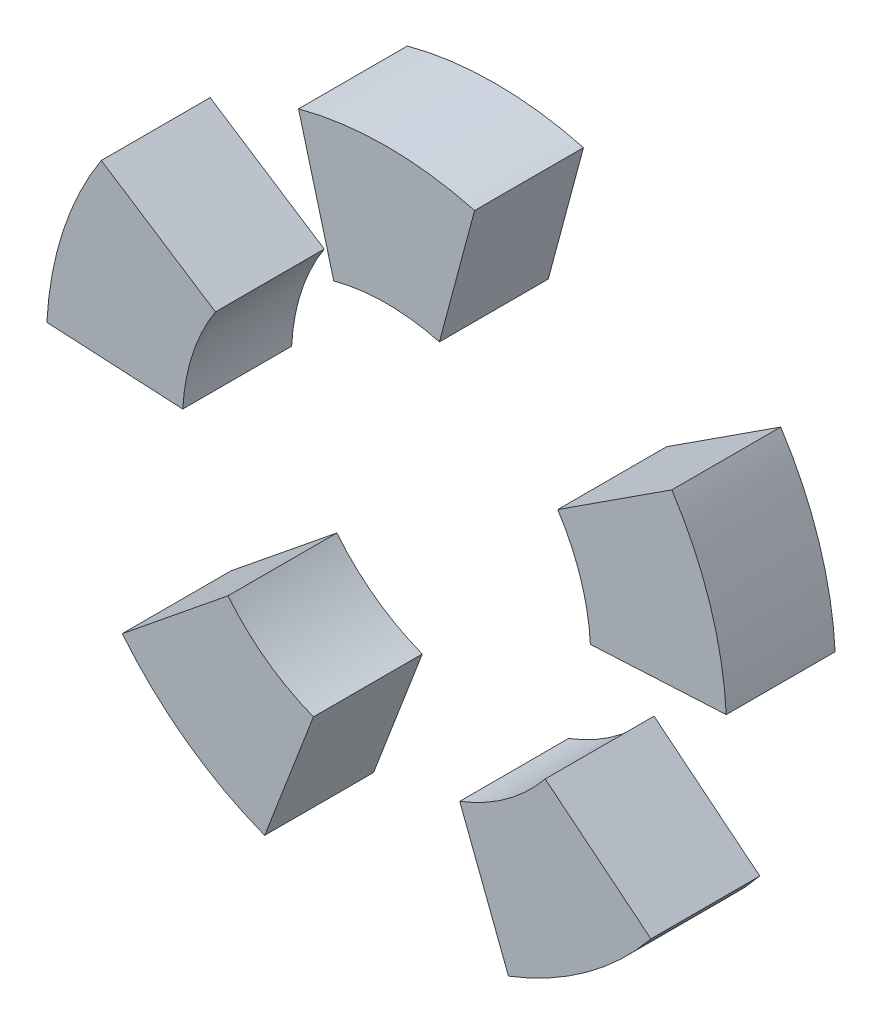
ISO-10303-21;
HEADER;
FILE_DESCRIPTION(('STEP AP214'),'2;1');
FILE_NAME('part.step','',(''),(''),'','','');
FILE_SCHEMA(('AUTOMOTIVE_DESIGN { 1 0 10303 214 1 1 1 1 }'));
ENDSEC;
DATA;
#1=APPLICATION_CONTEXT('core data for automotive mechanical design processes');
#2=APPLICATION_PROTOCOL_DEFINITION('international standard','automotive_design',2000,#1);
#3=PRODUCT_CONTEXT('',#1,'mechanical');
#4=PRODUCT('Part','Part','',(#3));
#5=PRODUCT_RELATED_PRODUCT_CATEGORY('part','',(#4));
#6=PRODUCT_DEFINITION_FORMATION('','',#4);
#7=PRODUCT_DEFINITION_CONTEXT('part definition',#1,'design');
#8=PRODUCT_DEFINITION('design','',#6,#7);
#9=PRODUCT_DEFINITION_SHAPE('','',#8);
#10=(LENGTH_UNIT() NAMED_UNIT(*) SI_UNIT(.MILLI.,.METRE.));
#11=(NAMED_UNIT(*) PLANE_ANGLE_UNIT() SI_UNIT($,.RADIAN.));
#12=(NAMED_UNIT(*) SI_UNIT($,.STERADIAN.) SOLID_ANGLE_UNIT());
#13=UNCERTAINTY_MEASURE_WITH_UNIT(LENGTH_MEASURE(1.E-05),#10,'distance_accuracy_value','');
#14=(GEOMETRIC_REPRESENTATION_CONTEXT(3) GLOBAL_UNCERTAINTY_ASSIGNED_CONTEXT((#13)) GLOBAL_UNIT_ASSIGNED_CONTEXT((#10,
#11,#12)) REPRESENTATION_CONTEXT('',''));
#15=CARTESIAN_POINT('',(0.,0.,0.));
#16=DIRECTION('',(0.,0.,1.));
#17=DIRECTION('',(1.,0.,0.));
#18=AXIS2_PLACEMENT_3D('',#15,#16,#17);
#19=CARTESIAN_POINT('',(0.,0.,8.));
#20=DIRECTION('',(0.,0.,-1.));
#21=DIRECTION('',(-1.,0.,0.));
#22=AXIS2_PLACEMENT_3D('',#19,#20,#21);
#23=CYLINDRICAL_SURFACE('',#22,25.);
#24=CARTESIAN_POINT('',(0.,0.,0.));
#25=DIRECTION('',(0.,0.,1.));
#26=DIRECTION('',(1.,0.,0.));
#27=AXIS2_PLACEMENT_3D('',#24,#25,#26);
#28=CIRCLE('',#27,25.);
#29=CARTESIAN_POINT('',(-19.4286490364245,-15.7330097762457,0.));
#30=VERTEX_POINT('',#29);
#31=CARTESIAN_POINT('',(-8.95919873863276,-23.33951066243,0.));
#32=VERTEX_POINT('',#31);
#33=EDGE_CURVE('E113',#30,#32,#28,.T.);
#34=ORIENTED_EDGE('',*,*,#33,.T.);
#35=DIRECTION('',(0.,0.,-1.));
#36=VECTOR('',#35,1.);
#37=CARTESIAN_POINT('',(-8.95919873863276,-23.33951066243,8.));
#38=LINE('',#37,#36);
#39=CARTESIAN_POINT('',(-8.95919873863276,-23.33951066243,8.));
#40=VERTEX_POINT('',#39);
#41=EDGE_CURVE('E12',#40,#32,#38,.T.);
#42=ORIENTED_EDGE('',*,*,#41,.F.);
#43=CARTESIAN_POINT('',(0.,0.,8.));
#44=DIRECTION('',(0.,0.,1.));
#45=DIRECTION('',(1.,0.,0.));
#46=AXIS2_PLACEMENT_3D('',#43,#44,#45);
#47=CIRCLE('',#46,25.);
#48=CARTESIAN_POINT('',(-19.4286490364245,-15.7330097762457,8.));
#49=VERTEX_POINT('',#48);
#50=EDGE_CURVE('E101',#49,#40,#47,.T.);
#51=ORIENTED_EDGE('',*,*,#50,.F.);
#52=DIRECTION('',(0.,0.,-1.));
#53=VECTOR('',#52,1.);
#54=CARTESIAN_POINT('',(-19.4286490364245,-15.7330097762457,8.));
#55=LINE('',#54,#53);
#56=EDGE_CURVE('E109',#49,#30,#55,.T.);
#57=ORIENTED_EDGE('',*,*,#56,.T.);
#58=EDGE_LOOP('',(#34,#42,#51,#57));
#59=FACE_BOUND('',#58,.T.);
#60=ADVANCED_FACE('F50',(#59),#23,.T.);
#61=CARTESIAN_POINT('',(-5.37551924317976,-14.0037063974579,8.));
#62=DIRECTION('',(-0.933580426497202,0.358367949545299,0.));
#63=DIRECTION('',(-0.3583679495453,-0.933580426497202,0.));
#64=AXIS2_PLACEMENT_3D('',#61,#62,#63);
#65=PLANE('',#64);
#66=DIRECTION('',(0.358367949545299,0.933580426497202,0.));
#67=VECTOR('',#66,1.);
#68=CARTESIAN_POINT('',(-5.37551924317976,-14.0037063974579,0.));
#69=LINE('',#68,#67);
#70=CARTESIAN_POINT('',(-5.37551924317976,-14.0037063974579,0.));
#71=VERTEX_POINT('',#70);
#72=EDGE_CURVE('E105',#32,#71,#69,.T.);
#73=ORIENTED_EDGE('',*,*,#72,.T.);
#74=DIRECTION('',(0.,0.,-1.));
#75=VECTOR('',#74,1.);
#76=CARTESIAN_POINT('',(-5.37551924317976,-14.0037063974579,8.));
#77=LINE('',#76,#75);
#78=CARTESIAN_POINT('',(-5.37551924317976,-14.0037063974579,8.));
#79=VERTEX_POINT('',#78);
#80=EDGE_CURVE('E58',#79,#71,#77,.T.);
#81=ORIENTED_EDGE('',*,*,#80,.F.);
#82=DIRECTION('',(0.358367949545299,0.933580426497202,0.));
#83=VECTOR('',#82,1.);
#84=CARTESIAN_POINT('',(-5.37551924317976,-14.0037063974579,8.));
#85=LINE('',#84,#83);
#86=EDGE_CURVE('E96',#40,#79,#85,.T.);
#87=ORIENTED_EDGE('',*,*,#86,.F.);
#88=ORIENTED_EDGE('',*,*,#41,.T.);
#89=EDGE_LOOP('',(#73,#81,#87,#88));
#90=FACE_BOUND('',#89,.T.);
#91=ADVANCED_FACE('F104',(#90),#65,.F.);
#92=CARTESIAN_POINT('',(0.,0.,8.));
#93=DIRECTION('',(0.,0.,-1.));
#94=DIRECTION('',(-1.,0.,0.));
#95=AXIS2_PLACEMENT_3D('',#92,#93,#94);
#96=CYLINDRICAL_SURFACE('',#95,15.);
#97=CARTESIAN_POINT('',(0.,0.,0.));
#98=DIRECTION('',(0.,0.,-1.));
#99=DIRECTION('',(1.,0.,0.));
#100=AXIS2_PLACEMENT_3D('',#97,#98,#99);
#101=CIRCLE('',#100,15.);
#102=CARTESIAN_POINT('',(-11.6571894218548,-9.43980586574733,0.));
#103=VERTEX_POINT('',#102);
#104=EDGE_CURVE('E83',#71,#103,#101,.T.);
#105=ORIENTED_EDGE('',*,*,#104,.T.);
#106=DIRECTION('',(0.,0.,-1.));
#107=VECTOR('',#106,1.);
#108=CARTESIAN_POINT('',(-11.6571894218548,-9.43980586574733,8.));
#109=LINE('',#108,#107);
#110=CARTESIAN_POINT('',(-11.6571894218548,-9.43980586574733,8.));
#111=VERTEX_POINT('',#110);
#112=EDGE_CURVE('E106',#111,#103,#109,.T.);
#113=ORIENTED_EDGE('',*,*,#112,.F.);
#114=CARTESIAN_POINT('',(0.,0.,8.));
#115=DIRECTION('',(0.,0.,-1.));
#116=DIRECTION('',(1.,0.,0.));
#117=AXIS2_PLACEMENT_3D('',#114,#115,#116);
#118=CIRCLE('',#117,15.);
#119=EDGE_CURVE('E99',#79,#111,#118,.T.);
#120=ORIENTED_EDGE('',*,*,#119,.F.);
#121=ORIENTED_EDGE('',*,*,#80,.T.);
#122=EDGE_LOOP('',(#105,#113,#120,#121));
#123=FACE_BOUND('',#122,.T.);
#124=ADVANCED_FACE('F107',(#123),#96,.F.);
#125=CARTESIAN_POINT('',(-11.6571894218548,-9.43980586574733,8.));
#126=DIRECTION('',(0.629320391049837,-0.777145961456971,0.));
#127=DIRECTION('',(0.777145961456971,0.629320391049837,0.));
#128=AXIS2_PLACEMENT_3D('',#125,#126,#127);
#129=PLANE('',#128);
#130=DIRECTION('',(-0.777145961456971,-0.629320391049837,0.));
#131=VECTOR('',#130,1.);
#132=CARTESIAN_POINT('',(-11.6571894218548,-9.43980586574733,0.));
#133=LINE('',#132,#131);
#134=EDGE_CURVE('E89',#103,#30,#133,.T.);
#135=ORIENTED_EDGE('',*,*,#134,.T.);
#136=ORIENTED_EDGE('',*,*,#56,.F.);
#137=DIRECTION('',(-0.777145961456971,-0.629320391049837,0.));
#138=VECTOR('',#137,1.);
#139=CARTESIAN_POINT('',(-11.6571894218548,-9.43980586574733,8.));
#140=LINE('',#139,#138);
#141=EDGE_CURVE('E66',#111,#49,#140,.T.);
#142=ORIENTED_EDGE('',*,*,#141,.F.);
#143=ORIENTED_EDGE('',*,*,#112,.T.);
#144=EDGE_LOOP('',(#135,#136,#142,#143));
#145=FACE_BOUND('',#144,.T.);
#146=ADVANCED_FACE('F120',(#145),#129,.F.);
#147=CARTESIAN_POINT('',(0.,0.,8.));
#148=DIRECTION('',(0.,0.,1.));
#149=DIRECTION('',(1.,0.,0.));
#150=AXIS2_PLACEMENT_3D('',#147,#148,#149);
#151=PLANE('',#150);
#152=ORIENTED_EDGE('',*,*,#50,.T.);
#153=ORIENTED_EDGE('',*,*,#86,.T.);
#154=ORIENTED_EDGE('',*,*,#119,.T.);
#155=ORIENTED_EDGE('',*,*,#141,.T.);
#156=EDGE_LOOP('',(#152,#153,#154,#155));
#157=FACE_BOUND('',#156,.T.);
#158=ADVANCED_FACE('F97',(#157),#151,.T.);
#159=CARTESIAN_POINT('',(0.,0.,0.));
#160=DIRECTION('',(0.,0.,1.));
#161=DIRECTION('',(1.,0.,0.));
#162=AXIS2_PLACEMENT_3D('',#159,#160,#161);
#163=PLANE('',#162);
#164=ORIENTED_EDGE('',*,*,#33,.F.);
#165=ORIENTED_EDGE('',*,*,#134,.F.);
#166=ORIENTED_EDGE('',*,*,#104,.F.);
#167=ORIENTED_EDGE('',*,*,#72,.F.);
#168=EDGE_LOOP('',(#164,#165,#166,#167));
#169=FACE_BOUND('',#168,.T.);
#170=ADVANCED_FACE('F123',(#169),#163,.F.);
#171=CLOSED_SHELL('',(#60,#91,#124,#146,#158,#170));
#172=MANIFOLD_SOLID_BREP('B2',#171);
#173=CARTESIAN_POINT('',(0.,0.,8.));
#174=DIRECTION('',(0.,0.,-1.));
#175=DIRECTION('',(-1.,0.,0.));
#176=AXIS2_PLACEMENT_3D('',#173,#174,#175);
#177=CYLINDRICAL_SURFACE('',#176,25.);
#178=CARTESIAN_POINT('',(0.,0.,0.));
#179=DIRECTION('',(0.,0.,1.));
#180=DIRECTION('',(1.,0.,0.));
#181=AXIS2_PLACEMENT_3D('',#178,#179,#180);
#182=CIRCLE('',#181,25.);
#183=CARTESIAN_POINT('',(8.95919873863223,-23.3395106624302,0.));
#184=VERTEX_POINT('',#183);
#185=CARTESIAN_POINT('',(19.4286490364241,-15.7330097762461,0.));
#186=VERTEX_POINT('',#185);
#187=EDGE_CURVE('E247',#184,#186,#182,.T.);
#188=ORIENTED_EDGE('',*,*,#187,.T.);
#189=DIRECTION('',(0.,0.,-1.));
#190=VECTOR('',#189,1.);
#191=CARTESIAN_POINT('',(19.4286490364241,-15.7330097762461,8.));
#192=LINE('',#191,#190);
#193=CARTESIAN_POINT('',(19.4286490364241,-15.7330097762461,8.));
#194=VERTEX_POINT('',#193);
#195=EDGE_CURVE('E48',#194,#186,#192,.T.);
#196=ORIENTED_EDGE('',*,*,#195,.F.);
#197=CARTESIAN_POINT('',(0.,0.,8.));
#198=DIRECTION('',(0.,0.,1.));
#199=DIRECTION('',(1.,0.,0.));
#200=AXIS2_PLACEMENT_3D('',#197,#198,#199);
#201=CIRCLE('',#200,25.);
#202=CARTESIAN_POINT('',(8.95919873863223,-23.3395106624302,8.));
#203=VERTEX_POINT('',#202);
#204=EDGE_CURVE('E235',#203,#194,#201,.T.);
#205=ORIENTED_EDGE('',*,*,#204,.F.);
#206=DIRECTION('',(0.,0.,-1.));
#207=VECTOR('',#206,1.);
#208=CARTESIAN_POINT('',(8.95919873863223,-23.3395106624302,8.));
#209=LINE('',#208,#207);
#210=EDGE_CURVE('E243',#203,#184,#209,.T.);
#211=ORIENTED_EDGE('',*,*,#210,.T.);
#212=EDGE_LOOP('',(#188,#196,#205,#211));
#213=FACE_BOUND('',#212,.T.);
#214=ADVANCED_FACE('F184',(#213),#177,.T.);
#215=CARTESIAN_POINT('',(11.6571894218544,-9.43980586574777,8.));
#216=DIRECTION('',(-0.629320391049837,-0.777145961456971,0.));
#217=DIRECTION('',(0.777145961456971,-0.629320391049837,0.));
#218=AXIS2_PLACEMENT_3D('',#215,#216,#217);
#219=PLANE('',#218);
#220=DIRECTION('',(-0.777145961456971,0.629320391049837,0.));
#221=VECTOR('',#220,1.);
#222=CARTESIAN_POINT('',(11.6571894218544,-9.43980586574777,0.));
#223=LINE('',#222,#221);
#224=CARTESIAN_POINT('',(11.6571894218544,-9.43980586574778,0.));
#225=VERTEX_POINT('',#224);
#226=EDGE_CURVE('E239',#186,#225,#223,.T.);
#227=ORIENTED_EDGE('',*,*,#226,.T.);
#228=DIRECTION('',(0.,0.,-1.));
#229=VECTOR('',#228,1.);
#230=CARTESIAN_POINT('',(11.6571894218544,-9.43980586574778,8.));
#231=LINE('',#230,#229);
#232=CARTESIAN_POINT('',(11.6571894218544,-9.43980586574778,8.));
#233=VERTEX_POINT('',#232);
#234=EDGE_CURVE('E192',#233,#225,#231,.T.);
#235=ORIENTED_EDGE('',*,*,#234,.F.);
#236=DIRECTION('',(-0.777145961456971,0.629320391049837,0.));
#237=VECTOR('',#236,1.);
#238=CARTESIAN_POINT('',(11.6571894218544,-9.43980586574777,8.));
#239=LINE('',#238,#237);
#240=EDGE_CURVE('E230',#194,#233,#239,.T.);
#241=ORIENTED_EDGE('',*,*,#240,.F.);
#242=ORIENTED_EDGE('',*,*,#195,.T.);
#243=EDGE_LOOP('',(#227,#235,#241,#242));
#244=FACE_BOUND('',#243,.T.);
#245=ADVANCED_FACE('F238',(#244),#219,.F.);
#246=CARTESIAN_POINT('',(0.,0.,8.));
#247=DIRECTION('',(0.,0.,-1.));
#248=DIRECTION('',(-1.,0.,0.));
#249=AXIS2_PLACEMENT_3D('',#246,#247,#248);
#250=CYLINDRICAL_SURFACE('',#249,15.);
#251=CARTESIAN_POINT('',(0.,0.,0.));
#252=DIRECTION('',(0.,0.,-1.));
#253=DIRECTION('',(1.,0.,0.));
#254=AXIS2_PLACEMENT_3D('',#251,#252,#253);
#255=CIRCLE('',#254,15.);
#256=CARTESIAN_POINT('',(5.37551924317923,-14.0037063974581,0.));
#257=VERTEX_POINT('',#256);
#258=EDGE_CURVE('E217',#225,#257,#255,.T.);
#259=ORIENTED_EDGE('',*,*,#258,.T.);
#260=DIRECTION('',(0.,0.,-1.));
#261=VECTOR('',#260,1.);
#262=CARTESIAN_POINT('',(5.37551924317923,-14.0037063974581,8.));
#263=LINE('',#262,#261);
#264=CARTESIAN_POINT('',(5.37551924317923,-14.0037063974581,8.));
#265=VERTEX_POINT('',#264);
#266=EDGE_CURVE('E240',#265,#257,#263,.T.);
#267=ORIENTED_EDGE('',*,*,#266,.F.);
#268=CARTESIAN_POINT('',(0.,0.,8.));
#269=DIRECTION('',(0.,0.,-1.));
#270=DIRECTION('',(1.,0.,0.));
#271=AXIS2_PLACEMENT_3D('',#268,#269,#270);
#272=CIRCLE('',#271,15.);
#273=EDGE_CURVE('E233',#233,#265,#272,.T.);
#274=ORIENTED_EDGE('',*,*,#273,.F.);
#275=ORIENTED_EDGE('',*,*,#234,.T.);
#276=EDGE_LOOP('',(#259,#267,#274,#275));
#277=FACE_BOUND('',#276,.T.);
#278=ADVANCED_FACE('F241',(#277),#250,.F.);
#279=CARTESIAN_POINT('',(5.37551924317923,-14.0037063974581,8.));
#280=DIRECTION('',(0.933580426497202,0.3583679495453,0.));
#281=DIRECTION('',(-0.3583679495453,0.933580426497202,0.));
#282=AXIS2_PLACEMENT_3D('',#279,#280,#281);
#283=PLANE('',#282);
#284=DIRECTION('',(0.3583679495453,-0.933580426497202,0.));
#285=VECTOR('',#284,1.);
#286=CARTESIAN_POINT('',(5.37551924317923,-14.0037063974581,0.));
#287=LINE('',#286,#285);
#288=EDGE_CURVE('E223',#257,#184,#287,.T.);
#289=ORIENTED_EDGE('',*,*,#288,.T.);
#290=ORIENTED_EDGE('',*,*,#210,.F.);
#291=DIRECTION('',(0.3583679495453,-0.933580426497202,0.));
#292=VECTOR('',#291,1.);
#293=CARTESIAN_POINT('',(5.37551924317923,-14.0037063974581,8.));
#294=LINE('',#293,#292);
#295=EDGE_CURVE('E200',#265,#203,#294,.T.);
#296=ORIENTED_EDGE('',*,*,#295,.F.);
#297=ORIENTED_EDGE('',*,*,#266,.T.);
#298=EDGE_LOOP('',(#289,#290,#296,#297));
#299=FACE_BOUND('',#298,.T.);
#300=ADVANCED_FACE('F254',(#299),#283,.F.);
#301=CARTESIAN_POINT('',(0.,0.,8.));
#302=DIRECTION('',(0.,0.,1.));
#303=DIRECTION('',(1.,0.,0.));
#304=AXIS2_PLACEMENT_3D('',#301,#302,#303);
#305=PLANE('',#304);
#306=ORIENTED_EDGE('',*,*,#204,.T.);
#307=ORIENTED_EDGE('',*,*,#240,.T.);
#308=ORIENTED_EDGE('',*,*,#273,.T.);
#309=ORIENTED_EDGE('',*,*,#295,.T.);
#310=EDGE_LOOP('',(#306,#307,#308,#309));
#311=FACE_BOUND('',#310,.T.);
#312=ADVANCED_FACE('F231',(#311),#305,.T.);
#313=CARTESIAN_POINT('',(0.,0.,0.));
#314=DIRECTION('',(0.,0.,1.));
#315=DIRECTION('',(1.,0.,0.));
#316=AXIS2_PLACEMENT_3D('',#313,#314,#315);
#317=PLANE('',#316);
#318=ORIENTED_EDGE('',*,*,#187,.F.);
#319=ORIENTED_EDGE('',*,*,#288,.F.);
#320=ORIENTED_EDGE('',*,*,#258,.F.);
#321=ORIENTED_EDGE('',*,*,#226,.F.);
#322=EDGE_LOOP('',(#318,#319,#320,#321));
#323=FACE_BOUND('',#322,.T.);
#324=ADVANCED_FACE('F257',(#323),#317,.F.);
#325=CLOSED_SHELL('',(#214,#245,#278,#300,#312,#324));
#326=MANIFOLD_SOLID_BREP('B6',#325);
#327=CARTESIAN_POINT('',(0.,0.,8.));
#328=DIRECTION('',(0.,0.,-1.));
#329=DIRECTION('',(-1.,0.,0.));
#330=AXIS2_PLACEMENT_3D('',#327,#328,#329);
#331=CYLINDRICAL_SURFACE('',#330,15.);
#332=CARTESIAN_POINT('',(0.,0.,0.));
#333=DIRECTION('',(0.,0.,-1.));
#334=DIRECTION('',(1.,0.,0.));
#335=AXIS2_PLACEMENT_3D('',#332,#333,#334);
#336=CIRCLE('',#335,15.);
#337=CARTESIAN_POINT('',(-14.9794430213186,0.785039343644433,0.));
#338=VERTEX_POINT('',#337);
#339=CARTESIAN_POINT('',(-12.5800585191812,8.16958552522566,0.));
#340=VERTEX_POINT('',#339);
#341=EDGE_CURVE('E381',#338,#340,#336,.T.);
#342=ORIENTED_EDGE('',*,*,#341,.T.);
#343=DIRECTION('',(0.,0.,-1.));
#344=VECTOR('',#343,1.);
#345=CARTESIAN_POINT('',(-12.5800585191812,8.16958552522566,8.));
#346=LINE('',#345,#344);
#347=CARTESIAN_POINT('',(-12.5800585191812,8.16958552522566,8.));
#348=VERTEX_POINT('',#347);
#349=EDGE_CURVE('E182',#348,#340,#346,.T.);
#350=ORIENTED_EDGE('',*,*,#349,.F.);
#351=CARTESIAN_POINT('',(0.,0.,8.));
#352=DIRECTION('',(0.,0.,-1.));
#353=DIRECTION('',(1.,0.,0.));
#354=AXIS2_PLACEMENT_3D('',#351,#352,#353);
#355=CIRCLE('',#354,15.);
#356=CARTESIAN_POINT('',(-14.9794430213186,0.785039343644433,8.));
#357=VERTEX_POINT('',#356);
#358=EDGE_CURVE('E369',#357,#348,#355,.T.);
#359=ORIENTED_EDGE('',*,*,#358,.F.);
#360=DIRECTION('',(0.,0.,-1.));
#361=VECTOR('',#360,1.);
#362=CARTESIAN_POINT('',(-14.9794430213186,0.785039343644433,8.));
#363=LINE('',#362,#361);
#364=EDGE_CURVE('E377',#357,#338,#363,.T.);
#365=ORIENTED_EDGE('',*,*,#364,.T.);
#366=EDGE_LOOP('',(#342,#350,#359,#365));
#367=FACE_BOUND('',#366,.T.);
#368=ADVANCED_FACE('F318',(#367),#331,.F.);
#369=CARTESIAN_POINT('',(-12.5800585191812,8.16958552522566,8.));
#370=DIRECTION('',(-0.544639035015027,-0.838670567945424,0.));
#371=DIRECTION('',(0.838670567945424,-0.544639035015027,0.));
#372=AXIS2_PLACEMENT_3D('',#369,#370,#371);
#373=PLANE('',#372);
#374=DIRECTION('',(-0.838670567945424,0.544639035015027,0.));
#375=VECTOR('',#374,1.);
#376=CARTESIAN_POINT('',(-12.5800585191812,8.16958552522566,0.));
#377=LINE('',#376,#375);
#378=CARTESIAN_POINT('',(-20.9667641986354,13.6159758753759,0.));
#379=VERTEX_POINT('',#378);
#380=EDGE_CURVE('E373',#340,#379,#377,.T.);
#381=ORIENTED_EDGE('',*,*,#380,.T.);
#382=DIRECTION('',(0.,0.,-1.));
#383=VECTOR('',#382,1.);
#384=CARTESIAN_POINT('',(-20.9667641986354,13.6159758753759,8.));
#385=LINE('',#384,#383);
#386=CARTESIAN_POINT('',(-20.9667641986354,13.6159758753759,8.));
#387=VERTEX_POINT('',#386);
#388=EDGE_CURVE('E326',#387,#379,#385,.T.);
#389=ORIENTED_EDGE('',*,*,#388,.F.);
#390=DIRECTION('',(-0.838670567945424,0.544639035015027,0.));
#391=VECTOR('',#390,1.);
#392=CARTESIAN_POINT('',(-12.5800585191812,8.16958552522566,8.));
#393=LINE('',#392,#391);
#394=EDGE_CURVE('E364',#348,#387,#393,.T.);
#395=ORIENTED_EDGE('',*,*,#394,.F.);
#396=ORIENTED_EDGE('',*,*,#349,.T.);
#397=EDGE_LOOP('',(#381,#389,#395,#396));
#398=FACE_BOUND('',#397,.T.);
#399=ADVANCED_FACE('F372',(#398),#373,.F.);
#400=CARTESIAN_POINT('',(0.,0.,8.));
#401=DIRECTION('',(0.,0.,-1.));
#402=DIRECTION('',(-1.,0.,0.));
#403=AXIS2_PLACEMENT_3D('',#400,#401,#402);
#404=CYLINDRICAL_SURFACE('',#403,25.);
#405=CARTESIAN_POINT('',(0.,0.,0.));
#406=DIRECTION('',(0.,0.,1.));
#407=DIRECTION('',(1.,0.,0.));
#408=AXIS2_PLACEMENT_3D('',#405,#406,#407);
#409=CIRCLE('',#408,25.);
#410=CARTESIAN_POINT('',(-24.9657383688643,1.30839890607386,0.));
#411=VERTEX_POINT('',#410);
#412=EDGE_CURVE('E351',#379,#411,#409,.T.);
#413=ORIENTED_EDGE('',*,*,#412,.T.);
#414=DIRECTION('',(0.,0.,-1.));
#415=VECTOR('',#414,1.);
#416=CARTESIAN_POINT('',(-24.9657383688643,1.30839890607386,8.));
#417=LINE('',#416,#415);
#418=CARTESIAN_POINT('',(-24.9657383688643,1.30839890607386,8.));
#419=VERTEX_POINT('',#418);
#420=EDGE_CURVE('E374',#419,#411,#417,.T.);
#421=ORIENTED_EDGE('',*,*,#420,.F.);
#422=CARTESIAN_POINT('',(0.,0.,8.));
#423=DIRECTION('',(0.,0.,1.));
#424=DIRECTION('',(1.,0.,0.));
#425=AXIS2_PLACEMENT_3D('',#422,#423,#424);
#426=CIRCLE('',#425,25.);
#427=EDGE_CURVE('E367',#387,#419,#426,.T.);
#428=ORIENTED_EDGE('',*,*,#427,.F.);
#429=ORIENTED_EDGE('',*,*,#388,.T.);
#430=EDGE_LOOP('',(#413,#421,#428,#429));
#431=FACE_BOUND('',#430,.T.);
#432=ADVANCED_FACE('F375',(#431),#404,.T.);
#433=CARTESIAN_POINT('',(-14.9794430213186,0.785039343644433,8.));
#434=DIRECTION('',(0.0523359562429428,0.998629534754574,0.));
#435=DIRECTION('',(-0.998629534754574,0.0523359562429428,0.));
#436=AXIS2_PLACEMENT_3D('',#433,#434,#435);
#437=PLANE('',#436);
#438=DIRECTION('',(0.998629534754574,-0.0523359562429428,0.));
#439=VECTOR('',#438,1.);
#440=CARTESIAN_POINT('',(-14.9794430213186,0.785039343644433,0.));
#441=LINE('',#440,#439);
#442=EDGE_CURVE('E357',#411,#338,#441,.T.);
#443=ORIENTED_EDGE('',*,*,#442,.T.);
#444=ORIENTED_EDGE('',*,*,#364,.F.);
#445=DIRECTION('',(0.998629534754574,-0.0523359562429428,0.));
#446=VECTOR('',#445,1.);
#447=CARTESIAN_POINT('',(-14.9794430213186,0.785039343644433,8.));
#448=LINE('',#447,#446);
#449=EDGE_CURVE('E334',#419,#357,#448,.T.);
#450=ORIENTED_EDGE('',*,*,#449,.F.);
#451=ORIENTED_EDGE('',*,*,#420,.T.);
#452=EDGE_LOOP('',(#443,#444,#450,#451));
#453=FACE_BOUND('',#452,.T.);
#454=ADVANCED_FACE('F388',(#453),#437,.F.);
#455=CARTESIAN_POINT('',(0.,0.,8.));
#456=DIRECTION('',(0.,0.,1.));
#457=DIRECTION('',(1.,0.,0.));
#458=AXIS2_PLACEMENT_3D('',#455,#456,#457);
#459=PLANE('',#458);
#460=ORIENTED_EDGE('',*,*,#358,.T.);
#461=ORIENTED_EDGE('',*,*,#394,.T.);
#462=ORIENTED_EDGE('',*,*,#427,.T.);
#463=ORIENTED_EDGE('',*,*,#449,.T.);
#464=EDGE_LOOP('',(#460,#461,#462,#463));
#465=FACE_BOUND('',#464,.T.);
#466=ADVANCED_FACE('F365',(#465),#459,.T.);
#467=CARTESIAN_POINT('',(0.,0.,0.));
#468=DIRECTION('',(0.,0.,1.));
#469=DIRECTION('',(1.,0.,0.));
#470=AXIS2_PLACEMENT_3D('',#467,#468,#469);
#471=PLANE('',#470);
#472=ORIENTED_EDGE('',*,*,#341,.F.);
#473=ORIENTED_EDGE('',*,*,#442,.F.);
#474=ORIENTED_EDGE('',*,*,#412,.F.);
#475=ORIENTED_EDGE('',*,*,#380,.F.);
#476=EDGE_LOOP('',(#472,#473,#474,#475));
#477=FACE_BOUND('',#476,.T.);
#478=ADVANCED_FACE('F391',(#477),#471,.F.);
#479=CLOSED_SHELL('',(#368,#399,#432,#454,#466,#478));
#480=MANIFOLD_SOLID_BREP('B42',#479);
#481=CARTESIAN_POINT('',(0.,0.,8.));
#482=DIRECTION('',(0.,0.,-1.));
#483=DIRECTION('',(-1.,0.,0.));
#484=AXIS2_PLACEMENT_3D('',#481,#482,#483);
#485=CYLINDRICAL_SURFACE('',#484,25.);
#486=CARTESIAN_POINT('',(0.,0.,0.));
#487=DIRECTION('',(0.,0.,1.));
#488=DIRECTION('',(1.,0.,0.));
#489=AXIS2_PLACEMENT_3D('',#486,#487,#488);
#490=CIRCLE('',#489,25.);
#491=CARTESIAN_POINT('',(24.9657383688644,1.30839890607329,0.));
#492=VERTEX_POINT('',#491);
#493=CARTESIAN_POINT('',(20.9667641986357,13.6159758753755,0.));
#494=VERTEX_POINT('',#493);
#495=EDGE_CURVE('E514',#492,#494,#490,.T.);
#496=ORIENTED_EDGE('',*,*,#495,.T.);
#497=DIRECTION('',(0.,0.,-1.));
#498=VECTOR('',#497,1.);
#499=CARTESIAN_POINT('',(20.9667641986357,13.6159758753755,8.));
#500=LINE('',#499,#498);
#501=CARTESIAN_POINT('',(20.9667641986357,13.6159758753755,8.));
#502=VERTEX_POINT('',#501);
#503=EDGE_CURVE('E316',#502,#494,#500,.T.);
#504=ORIENTED_EDGE('',*,*,#503,.F.);
#505=CARTESIAN_POINT('',(0.,0.,8.));
#506=DIRECTION('',(0.,0.,1.));
#507=DIRECTION('',(1.,0.,0.));
#508=AXIS2_PLACEMENT_3D('',#505,#506,#507);
#509=CIRCLE('',#508,25.);
#510=CARTESIAN_POINT('',(24.9657383688644,1.30839890607329,8.));
#511=VERTEX_POINT('',#510);
#512=EDGE_CURVE('E502',#511,#502,#509,.T.);
#513=ORIENTED_EDGE('',*,*,#512,.F.);
#514=DIRECTION('',(0.,0.,-1.));
#515=VECTOR('',#514,1.);
#516=CARTESIAN_POINT('',(24.9657383688644,1.30839890607329,8.));
#517=LINE('',#516,#515);
#518=EDGE_CURVE('E510',#511,#492,#517,.T.);
#519=ORIENTED_EDGE('',*,*,#518,.T.);
#520=EDGE_LOOP('',(#496,#504,#513,#519));
#521=FACE_BOUND('',#520,.T.);
#522=ADVANCED_FACE('F451',(#521),#485,.T.);
#523=CARTESIAN_POINT('',(12.5800585191815,8.16958552522518,8.));
#524=DIRECTION('',(0.544639035015028,-0.838670567945424,0.));
#525=DIRECTION('',(0.838670567945423,0.544639035015028,0.));
#526=AXIS2_PLACEMENT_3D('',#523,#524,#525);
#527=PLANE('',#526);
#528=DIRECTION('',(-0.838670567945424,-0.544639035015028,0.));
#529=VECTOR('',#528,1.);
#530=CARTESIAN_POINT('',(12.5800585191815,8.16958552522518,0.));
#531=LINE('',#530,#529);
#532=CARTESIAN_POINT('',(12.5800585191815,8.16958552522518,0.));
#533=VERTEX_POINT('',#532);
#534=EDGE_CURVE('E506',#494,#533,#531,.T.);
#535=ORIENTED_EDGE('',*,*,#534,.T.);
#536=DIRECTION('',(0.,0.,-1.));
#537=VECTOR('',#536,1.);
#538=CARTESIAN_POINT('',(12.5800585191815,8.16958552522518,8.));
#539=LINE('',#538,#537);
#540=CARTESIAN_POINT('',(12.5800585191815,8.16958552522518,8.));
#541=VERTEX_POINT('',#540);
#542=EDGE_CURVE('E459',#541,#533,#539,.T.);
#543=ORIENTED_EDGE('',*,*,#542,.F.);
#544=DIRECTION('',(-0.838670567945424,-0.544639035015028,0.));
#545=VECTOR('',#544,1.);
#546=CARTESIAN_POINT('',(12.5800585191815,8.16958552522518,8.));
#547=LINE('',#546,#545);
#548=EDGE_CURVE('E497',#502,#541,#547,.T.);
#549=ORIENTED_EDGE('',*,*,#548,.F.);
#550=ORIENTED_EDGE('',*,*,#503,.T.);
#551=EDGE_LOOP('',(#535,#543,#549,#550));
#552=FACE_BOUND('',#551,.T.);
#553=ADVANCED_FACE('F505',(#552),#527,.F.);
#554=CARTESIAN_POINT('',(0.,0.,8.));
#555=DIRECTION('',(0.,0.,-1.));
#556=DIRECTION('',(-1.,0.,0.));
#557=AXIS2_PLACEMENT_3D('',#554,#555,#556);
#558=CYLINDRICAL_SURFACE('',#557,15.);
#559=CARTESIAN_POINT('',(0.,0.,0.));
#560=DIRECTION('',(0.,0.,-1.));
#561=DIRECTION('',(1.,0.,0.));
#562=AXIS2_PLACEMENT_3D('',#559,#560,#561);
#563=CIRCLE('',#562,15.);
#564=CARTESIAN_POINT('',(14.9794430213186,0.785039343643862,0.));
#565=VERTEX_POINT('',#564);
#566=EDGE_CURVE('E484',#533,#565,#563,.T.);
#567=ORIENTED_EDGE('',*,*,#566,.T.);
#568=DIRECTION('',(0.,0.,-1.));
#569=VECTOR('',#568,1.);
#570=CARTESIAN_POINT('',(14.9794430213186,0.785039343643862,8.));
#571=LINE('',#570,#569);
#572=CARTESIAN_POINT('',(14.9794430213186,0.785039343643862,8.));
#573=VERTEX_POINT('',#572);
#574=EDGE_CURVE('E507',#573,#565,#571,.T.);
#575=ORIENTED_EDGE('',*,*,#574,.F.);
#576=CARTESIAN_POINT('',(0.,0.,8.));
#577=DIRECTION('',(0.,0.,-1.));
#578=DIRECTION('',(1.,0.,0.));
#579=AXIS2_PLACEMENT_3D('',#576,#577,#578);
#580=CIRCLE('',#579,15.);
#581=EDGE_CURVE('E500',#541,#573,#580,.T.);
#582=ORIENTED_EDGE('',*,*,#581,.F.);
#583=ORIENTED_EDGE('',*,*,#542,.T.);
#584=EDGE_LOOP('',(#567,#575,#582,#583));
#585=FACE_BOUND('',#584,.T.);
#586=ADVANCED_FACE('F508',(#585),#558,.F.);
#587=CARTESIAN_POINT('',(14.9794430213186,0.785039343643862,8.));
#588=DIRECTION('',(-0.0523359562429433,0.998629534754574,0.));
#589=DIRECTION('',(-0.998629534754574,-0.0523359562429433,0.));
#590=AXIS2_PLACEMENT_3D('',#587,#588,#589);
#591=PLANE('',#590);
#592=DIRECTION('',(0.998629534754574,0.0523359562429433,0.));
#593=VECTOR('',#592,1.);
#594=CARTESIAN_POINT('',(14.9794430213186,0.785039343643862,0.));
#595=LINE('',#594,#593);
#596=EDGE_CURVE('E490',#565,#492,#595,.T.);
#597=ORIENTED_EDGE('',*,*,#596,.T.);
#598=ORIENTED_EDGE('',*,*,#518,.F.);
#599=DIRECTION('',(0.998629534754574,0.0523359562429433,0.));
#600=VECTOR('',#599,1.);
#601=CARTESIAN_POINT('',(14.9794430213186,0.785039343643862,8.));
#602=LINE('',#601,#600);
#603=EDGE_CURVE('E467',#573,#511,#602,.T.);
#604=ORIENTED_EDGE('',*,*,#603,.F.);
#605=ORIENTED_EDGE('',*,*,#574,.T.);
#606=EDGE_LOOP('',(#597,#598,#604,#605));
#607=FACE_BOUND('',#606,.T.);
#608=ADVANCED_FACE('F521',(#607),#591,.F.);
#609=CARTESIAN_POINT('',(0.,0.,8.));
#610=DIRECTION('',(0.,0.,1.));
#611=DIRECTION('',(1.,0.,0.));
#612=AXIS2_PLACEMENT_3D('',#609,#610,#611);
#613=PLANE('',#612);
#614=ORIENTED_EDGE('',*,*,#512,.T.);
#615=ORIENTED_EDGE('',*,*,#548,.T.);
#616=ORIENTED_EDGE('',*,*,#581,.T.);
#617=ORIENTED_EDGE('',*,*,#603,.T.);
#618=EDGE_LOOP('',(#614,#615,#616,#617));
#619=FACE_BOUND('',#618,.T.);
#620=ADVANCED_FACE('F498',(#619),#613,.T.);
#621=CARTESIAN_POINT('',(0.,0.,0.));
#622=DIRECTION('',(0.,0.,1.));
#623=DIRECTION('',(1.,0.,0.));
#624=AXIS2_PLACEMENT_3D('',#621,#622,#623);
#625=PLANE('',#624);
#626=ORIENTED_EDGE('',*,*,#495,.F.);
#627=ORIENTED_EDGE('',*,*,#596,.F.);
#628=ORIENTED_EDGE('',*,*,#566,.F.);
#629=ORIENTED_EDGE('',*,*,#534,.F.);
#630=EDGE_LOOP('',(#626,#627,#628,#629));
#631=FACE_BOUND('',#630,.T.);
#632=ADVANCED_FACE('F524',(#631),#625,.F.);
#633=CLOSED_SHELL('',(#522,#553,#586,#608,#620,#632));
#634=MANIFOLD_SOLID_BREP('B176',#633);
#635=CARTESIAN_POINT('',(0.,0.,8.));
#636=DIRECTION('',(0.,0.,-1.));
#637=DIRECTION('',(-1.,0.,0.));
#638=AXIS2_PLACEMENT_3D('',#635,#636,#637);
#639=CYLINDRICAL_SURFACE('',#638,25.);
#640=CARTESIAN_POINT('',(0.,0.,0.));
#641=DIRECTION('',(0.,0.,1.));
#642=DIRECTION('',(1.,0.,0.));
#643=AXIS2_PLACEMENT_3D('',#640,#641,#642);
#644=CIRCLE('',#643,25.);
#645=CARTESIAN_POINT('',(6.47047612756331,24.1481456572266,0.));
#646=VERTEX_POINT('',#645);
#647=CARTESIAN_POINT('',(-6.47047612756276,24.1481456572268,0.));
#648=VERTEX_POINT('',#647);
#649=EDGE_CURVE('E643',#646,#648,#644,.T.);
#650=ORIENTED_EDGE('',*,*,#649,.T.);
#651=DIRECTION('',(0.,0.,-1.));
#652=VECTOR('',#651,1.);
#653=CARTESIAN_POINT('',(-6.47047612756276,24.1481456572268,8.));
#654=LINE('',#653,#652);
#655=CARTESIAN_POINT('',(-6.47047612756276,24.1481456572268,8.));
#656=VERTEX_POINT('',#655);
#657=EDGE_CURVE('E449',#656,#648,#654,.T.);
#658=ORIENTED_EDGE('',*,*,#657,.F.);
#659=CARTESIAN_POINT('',(0.,0.,8.));
#660=DIRECTION('',(0.,0.,1.));
#661=DIRECTION('',(1.,0.,0.));
#662=AXIS2_PLACEMENT_3D('',#659,#660,#661);
#663=CIRCLE('',#662,25.);
#664=CARTESIAN_POINT('',(6.47047612756331,24.1481456572266,8.));
#665=VERTEX_POINT('',#664);
#666=EDGE_CURVE('E627',#665,#656,#663,.T.);
#667=ORIENTED_EDGE('',*,*,#666,.F.);
#668=DIRECTION('',(0.,0.,-1.));
#669=VECTOR('',#668,1.);
#670=CARTESIAN_POINT('',(6.47047612756331,24.1481456572266,8.));
#671=LINE('',#670,#669);
#672=EDGE_CURVE('E639',#665,#646,#671,.T.);
#673=ORIENTED_EDGE('',*,*,#672,.T.);
#674=EDGE_LOOP('',(#650,#658,#667,#673));
#675=FACE_BOUND('',#674,.T.);
#676=ADVANCED_FACE('F575',(#675),#639,.T.);
#677=CARTESIAN_POINT('',(-3.88228567653755,14.4888873943361,8.));
#678=DIRECTION('',(0.965925826289068,0.258819045102522,0.));
#679=DIRECTION('',(-0.258819045102522,0.965925826289068,0.));
#680=AXIS2_PLACEMENT_3D('',#677,#678,#679);
#681=PLANE('',#680);
#682=DIRECTION('',(0.258819045102522,-0.965925826289068,0.));
#683=VECTOR('',#682,1.);
#684=CARTESIAN_POINT('',(-3.88228567653755,14.4888873943361,0.));
#685=LINE('',#684,#683);
#686=CARTESIAN_POINT('',(-3.88228567653755,14.4888873943361,0.));
#687=VERTEX_POINT('',#686);
#688=EDGE_CURVE('E632',#648,#687,#685,.T.);
#689=ORIENTED_EDGE('',*,*,#688,.T.);
#690=DIRECTION('',(0.,0.,-1.));
#691=VECTOR('',#690,1.);
#692=CARTESIAN_POINT('',(-3.88228567653755,14.4888873943361,8.));
#693=LINE('',#692,#691);
#694=CARTESIAN_POINT('',(-3.88228567653755,14.4888873943361,8.));
#695=VERTEX_POINT('',#694);
#696=EDGE_CURVE('E584',#695,#687,#693,.T.);
#697=ORIENTED_EDGE('',*,*,#696,.F.);
#698=DIRECTION('',(0.258819045102522,-0.965925826289068,0.));
#699=VECTOR('',#698,1.);
#700=CARTESIAN_POINT('',(-3.88228567653755,14.4888873943361,8.));
#701=LINE('',#700,#699);
#702=EDGE_CURVE('E622',#656,#695,#701,.T.);
#703=ORIENTED_EDGE('',*,*,#702,.F.);
#704=ORIENTED_EDGE('',*,*,#657,.T.);
#705=EDGE_LOOP('',(#689,#697,#703,#704));
#706=FACE_BOUND('',#705,.T.);
#707=ADVANCED_FACE('F631',(#706),#681,.F.);
#708=CARTESIAN_POINT('',(0.,0.,8.));
#709=DIRECTION('',(0.,0.,-1.));
#710=DIRECTION('',(-1.,0.,0.));
#711=AXIS2_PLACEMENT_3D('',#708,#709,#710);
#712=CYLINDRICAL_SURFACE('',#711,15.);
#713=CARTESIAN_POINT('',(0.,0.,0.));
#714=DIRECTION('',(0.,0.,-1.));
#715=DIRECTION('',(1.,0.,0.));
#716=AXIS2_PLACEMENT_3D('',#713,#714,#715);
#717=CIRCLE('',#716,15.);
#718=CARTESIAN_POINT('',(3.8822856765381,14.4888873943359,0.));
#719=VERTEX_POINT('',#718);
#720=EDGE_CURVE('E609',#687,#719,#717,.T.);
#721=ORIENTED_EDGE('',*,*,#720,.T.);
#722=DIRECTION('',(0.,0.,-1.));
#723=VECTOR('',#722,1.);
#724=CARTESIAN_POINT('',(3.8822856765381,14.4888873943359,8.));
#725=LINE('',#724,#723);
#726=CARTESIAN_POINT('',(3.8822856765381,14.4888873943359,8.));
#727=VERTEX_POINT('',#726);
#728=EDGE_CURVE('E634',#727,#719,#725,.T.);
#729=ORIENTED_EDGE('',*,*,#728,.F.);
#730=CARTESIAN_POINT('',(0.,0.,8.));
#731=DIRECTION('',(0.,0.,-1.));
#732=DIRECTION('',(1.,0.,0.));
#733=AXIS2_PLACEMENT_3D('',#730,#731,#732);
#734=CIRCLE('',#733,15.);
#735=EDGE_CURVE('E625',#695,#727,#734,.T.);
#736=ORIENTED_EDGE('',*,*,#735,.F.);
#737=ORIENTED_EDGE('',*,*,#696,.T.);
#738=EDGE_LOOP('',(#721,#729,#736,#737));
#739=FACE_BOUND('',#738,.T.);
#740=ADVANCED_FACE('F635',(#739),#712,.F.);
#741=CARTESIAN_POINT('',(3.8822856765381,14.4888873943359,8.));
#742=DIRECTION('',(-0.965925826289068,0.258819045102521,0.));
#743=DIRECTION('',(-0.258819045102521,-0.965925826289068,0.));
#744=AXIS2_PLACEMENT_3D('',#741,#742,#743);
#745=PLANE('',#744);
#746=DIRECTION('',(0.258819045102521,0.965925826289068,0.));
#747=VECTOR('',#746,1.);
#748=CARTESIAN_POINT('',(3.8822856765381,14.4888873943359,0.));
#749=LINE('',#748,#747);
#750=EDGE_CURVE('E615',#719,#646,#749,.T.);
#751=ORIENTED_EDGE('',*,*,#750,.T.);
#752=ORIENTED_EDGE('',*,*,#672,.F.);
#753=DIRECTION('',(0.258819045102521,0.965925826289068,0.));
#754=VECTOR('',#753,1.);
#755=CARTESIAN_POINT('',(3.8822856765381,14.4888873943359,8.));
#756=LINE('',#755,#754);
#757=EDGE_CURVE('E592',#727,#665,#756,.T.);
#758=ORIENTED_EDGE('',*,*,#757,.F.);
#759=ORIENTED_EDGE('',*,*,#728,.T.);
#760=EDGE_LOOP('',(#751,#752,#758,#759));
#761=FACE_BOUND('',#760,.T.);
#762=ADVANCED_FACE('F656',(#761),#745,.F.);
#763=CARTESIAN_POINT('',(0.,0.,8.));
#764=DIRECTION('',(0.,0.,1.));
#765=DIRECTION('',(1.,0.,0.));
#766=AXIS2_PLACEMENT_3D('',#763,#764,#765);
#767=PLANE('',#766);
#768=ORIENTED_EDGE('',*,*,#666,.T.);
#769=ORIENTED_EDGE('',*,*,#702,.T.);
#770=ORIENTED_EDGE('',*,*,#735,.T.);
#771=ORIENTED_EDGE('',*,*,#757,.T.);
#772=EDGE_LOOP('',(#768,#769,#770,#771));
#773=FACE_BOUND('',#772,.T.);
#774=ADVANCED_FACE('F623',(#773),#767,.T.);
#775=CARTESIAN_POINT('',(0.,0.,0.));
#776=DIRECTION('',(0.,0.,1.));
#777=DIRECTION('',(1.,0.,0.));
#778=AXIS2_PLACEMENT_3D('',#775,#776,#777);
#779=PLANE('',#778);
#780=ORIENTED_EDGE('',*,*,#649,.F.);
#781=ORIENTED_EDGE('',*,*,#750,.F.);
#782=ORIENTED_EDGE('',*,*,#720,.F.);
#783=ORIENTED_EDGE('',*,*,#688,.F.);
#784=EDGE_LOOP('',(#780,#781,#782,#783));
#785=FACE_BOUND('',#784,.T.);
#786=ADVANCED_FACE('F659',(#785),#779,.F.);
#787=CLOSED_SHELL('',(#676,#707,#740,#762,#774,#786));
#788=MANIFOLD_SOLID_BREP('B310',#787);
#789=ADVANCED_BREP_SHAPE_REPRESENTATION('',(#18,#172,#326,#480,#634,#788),#14);
#790=SHAPE_DEFINITION_REPRESENTATION(#9,#789);
ENDSEC;
END-ISO-10303-21;
